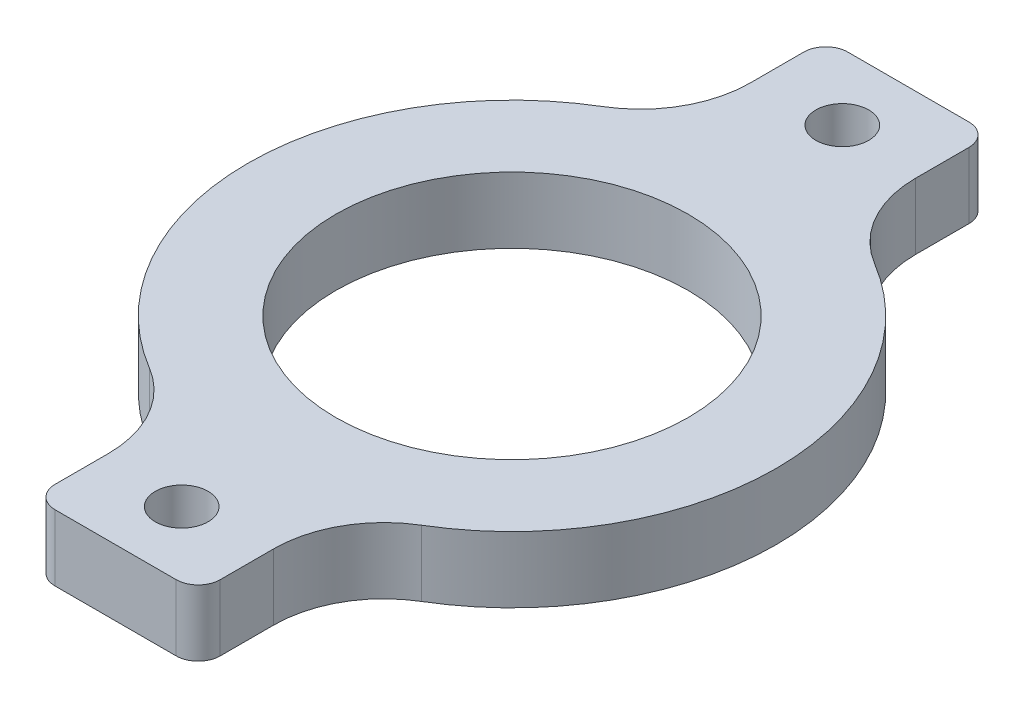
ISO-10303-21;
HEADER;
FILE_DESCRIPTION(('STEP AP214'),'2;1');
FILE_NAME('part.step','',(''),(''),'','','');
FILE_SCHEMA(('AUTOMOTIVE_DESIGN { 1 0 10303 214 1 1 1 1 }'));
ENDSEC;
DATA;
#1=APPLICATION_CONTEXT('core data for automotive mechanical design processes');
#2=APPLICATION_PROTOCOL_DEFINITION('international standard','automotive_design',2000,#1);
#3=PRODUCT_CONTEXT('',#1,'mechanical');
#4=PRODUCT('Part','Part','',(#3));
#5=PRODUCT_RELATED_PRODUCT_CATEGORY('part','',(#4));
#6=PRODUCT_DEFINITION_FORMATION('','',#4);
#7=PRODUCT_DEFINITION_CONTEXT('part definition',#1,'design');
#8=PRODUCT_DEFINITION('design','',#6,#7);
#9=PRODUCT_DEFINITION_SHAPE('','',#8);
#10=(LENGTH_UNIT() NAMED_UNIT(*) SI_UNIT(.MILLI.,.METRE.));
#11=(NAMED_UNIT(*) PLANE_ANGLE_UNIT() SI_UNIT($,.RADIAN.));
#12=(NAMED_UNIT(*) SI_UNIT($,.STERADIAN.) SOLID_ANGLE_UNIT());
#13=UNCERTAINTY_MEASURE_WITH_UNIT(LENGTH_MEASURE(1.E-05),#10,'distance_accuracy_value','');
#14=(GEOMETRIC_REPRESENTATION_CONTEXT(3) GLOBAL_UNCERTAINTY_ASSIGNED_CONTEXT((#13)) GLOBAL_UNIT_ASSIGNED_CONTEXT((#10,
#11,#12)) REPRESENTATION_CONTEXT('',''));
#15=CARTESIAN_POINT('',(0.,0.,0.));
#16=DIRECTION('',(0.,0.,1.));
#17=DIRECTION('',(1.,0.,0.));
#18=AXIS2_PLACEMENT_3D('',#15,#16,#17);
#19=CARTESIAN_POINT('',(0.,3.,0.));
#20=DIRECTION('',(0.,1.,0.));
#21=DIRECTION('',(0.,0.,1.));
#22=AXIS2_PLACEMENT_3D('',#19,#20,#21);
#23=PLANE('',#22);
#24=CARTESIAN_POINT('',(0.,3.,-15.));
#25=DIRECTION('',(0.,1.,0.));
#26=DIRECTION('',(0.,0.,1.));
#27=AXIS2_PLACEMENT_3D('',#24,#25,#26);
#28=CIRCLE('',#27,1.2);
#29=CARTESIAN_POINT('',(0.,3.,-13.8));
#30=VERTEX_POINT('',#29);
#31=EDGE_CURVE('E311',#30,#30,#28,.T.);
#32=ORIENTED_EDGE('',*,*,#31,.F.);
#33=EDGE_LOOP('',(#32));
#34=FACE_BOUND('',#33,.T.);
#35=CARTESIAN_POINT('',(0.,3.,15.));
#36=DIRECTION('',(0.,1.,0.));
#37=DIRECTION('',(0.,0.,1.));
#38=AXIS2_PLACEMENT_3D('',#35,#36,#37);
#39=CIRCLE('',#38,1.2);
#40=CARTESIAN_POINT('',(0.,3.,16.2));
#41=VERTEX_POINT('',#40);
#42=EDGE_CURVE('E305',#41,#41,#39,.T.);
#43=ORIENTED_EDGE('',*,*,#42,.F.);
#44=EDGE_LOOP('',(#43));
#45=FACE_BOUND('',#44,.T.);
#46=DIRECTION('',(1.,0.,0.));
#47=VECTOR('',#46,1.);
#48=CARTESIAN_POINT('',(-3.75,3.,18.));
#49=LINE('',#48,#47);
#50=CARTESIAN_POINT('',(-2.75,3.,18.));
#51=VERTEX_POINT('',#50);
#52=CARTESIAN_POINT('',(2.75,3.,18.));
#53=VERTEX_POINT('',#52);
#54=EDGE_CURVE('E288',#51,#53,#49,.T.);
#55=ORIENTED_EDGE('',*,*,#54,.T.);
#56=CARTESIAN_POINT('',(2.75,3.,17.));
#57=DIRECTION('',(0.,1.,0.));
#58=DIRECTION('',(0.,0.,1.));
#59=AXIS2_PLACEMENT_3D('',#56,#57,#58);
#60=CIRCLE('',#59,1.);
#61=CARTESIAN_POINT('',(3.75,3.,17.));
#62=VERTEX_POINT('',#61);
#63=EDGE_CURVE('E247',#53,#62,#60,.T.);
#64=ORIENTED_EDGE('',*,*,#63,.T.);
#65=DIRECTION('',(0.,0.,-1.));
#66=VECTOR('',#65,1.);
#67=CARTESIAN_POINT('',(3.75,3.,18.));
#68=LINE('',#67,#66);
#69=CARTESIAN_POINT('',(3.75,3.,14.5752358471484));
#70=VERTEX_POINT('',#69);
#71=EDGE_CURVE('E286',#62,#70,#68,.T.);
#72=ORIENTED_EDGE('',*,*,#71,.T.);
#73=CARTESIAN_POINT('',(8.75,3.,14.5752358471484));
#74=DIRECTION('',(0.,1.,0.));
#75=DIRECTION('',(0.,0.,1.));
#76=AXIS2_PLACEMENT_3D('',#73,#74,#75);
#77=CIRCLE('',#76,5.);
#78=CARTESIAN_POINT('',(6.1764705882353,3.,10.2884017744577));
#79=VERTEX_POINT('',#78);
#80=EDGE_CURVE('E216',#70,#79,#77,.F.);
#81=ORIENTED_EDGE('',*,*,#80,.T.);
#82=CARTESIAN_POINT('',(0.,3.,0.));
#83=DIRECTION('',(0.,1.,0.));
#84=DIRECTION('',(0.,0.,1.));
#85=AXIS2_PLACEMENT_3D('',#82,#83,#84);
#86=CIRCLE('',#85,12.);
#87=CARTESIAN_POINT('',(6.1764705882353,3.,-10.2884017744577));
#88=VERTEX_POINT('',#87);
#89=EDGE_CURVE('E174',#79,#88,#86,.T.);
#90=ORIENTED_EDGE('',*,*,#89,.T.);
#91=CARTESIAN_POINT('',(8.75,3.,-14.5752358471484));
#92=DIRECTION('',(0.,1.,0.));
#93=DIRECTION('',(0.,0.,1.));
#94=AXIS2_PLACEMENT_3D('',#91,#92,#93);
#95=CIRCLE('',#94,5.);
#96=CARTESIAN_POINT('',(3.75,3.,-14.5752358471484));
#97=VERTEX_POINT('',#96);
#98=EDGE_CURVE('E220',#88,#97,#95,.F.);
#99=ORIENTED_EDGE('',*,*,#98,.T.);
#100=DIRECTION('',(0.,0.,-1.));
#101=VECTOR('',#100,1.);
#102=CARTESIAN_POINT('',(3.75,3.,-18.));
#103=LINE('',#102,#101);
#104=CARTESIAN_POINT('',(3.75,3.,-17.));
#105=VERTEX_POINT('',#104);
#106=EDGE_CURVE('E194',#97,#105,#103,.T.);
#107=ORIENTED_EDGE('',*,*,#106,.T.);
#108=CARTESIAN_POINT('',(2.75,3.,-17.));
#109=DIRECTION('',(0.,1.,0.));
#110=DIRECTION('',(0.,0.,1.));
#111=AXIS2_PLACEMENT_3D('',#108,#109,#110);
#112=CIRCLE('',#111,1.);
#113=CARTESIAN_POINT('',(2.75,3.,-18.));
#114=VERTEX_POINT('',#113);
#115=EDGE_CURVE('E243',#105,#114,#112,.T.);
#116=ORIENTED_EDGE('',*,*,#115,.T.);
#117=DIRECTION('',(-1.,0.,0.));
#118=VECTOR('',#117,1.);
#119=CARTESIAN_POINT('',(-3.75,3.,-18.));
#120=LINE('',#119,#118);
#121=CARTESIAN_POINT('',(-2.75,3.,-18.));
#122=VERTEX_POINT('',#121);
#123=EDGE_CURVE('E270',#114,#122,#120,.T.);
#124=ORIENTED_EDGE('',*,*,#123,.T.);
#125=CARTESIAN_POINT('',(-2.75,3.,-17.));
#126=DIRECTION('',(0.,1.,0.));
#127=DIRECTION('',(0.,0.,1.));
#128=AXIS2_PLACEMENT_3D('',#125,#126,#127);
#129=CIRCLE('',#128,1.);
#130=CARTESIAN_POINT('',(-3.75,3.,-17.));
#131=VERTEX_POINT('',#130);
#132=EDGE_CURVE('E64',#122,#131,#129,.T.);
#133=ORIENTED_EDGE('',*,*,#132,.T.);
#134=DIRECTION('',(0.,0.,1.));
#135=VECTOR('',#134,1.);
#136=CARTESIAN_POINT('',(-3.75,3.,-18.));
#137=LINE('',#136,#135);
#138=CARTESIAN_POINT('',(-3.75,3.,-14.5752358471484));
#139=VERTEX_POINT('',#138);
#140=EDGE_CURVE('E294',#131,#139,#137,.T.);
#141=ORIENTED_EDGE('',*,*,#140,.T.);
#142=CARTESIAN_POINT('',(-8.75,3.,-14.5752358471484));
#143=DIRECTION('',(0.,1.,0.));
#144=DIRECTION('',(0.,0.,1.));
#145=AXIS2_PLACEMENT_3D('',#142,#143,#144);
#146=CIRCLE('',#145,5.);
#147=CARTESIAN_POINT('',(-6.1764705882353,3.,-10.2884017744577));
#148=VERTEX_POINT('',#147);
#149=EDGE_CURVE('E225',#139,#148,#146,.F.);
#150=ORIENTED_EDGE('',*,*,#149,.T.);
#151=CARTESIAN_POINT('',(0.,3.,0.));
#152=DIRECTION('',(0.,1.,0.));
#153=DIRECTION('',(0.,0.,1.));
#154=AXIS2_PLACEMENT_3D('',#151,#152,#153);
#155=CIRCLE('',#154,12.);
#156=CARTESIAN_POINT('',(-6.1764705882353,3.,10.2884017744577));
#157=VERTEX_POINT('',#156);
#158=EDGE_CURVE('E291',#148,#157,#155,.T.);
#159=ORIENTED_EDGE('',*,*,#158,.T.);
#160=CARTESIAN_POINT('',(-8.75,3.,14.5752358471484));
#161=DIRECTION('',(0.,1.,0.));
#162=DIRECTION('',(0.,0.,1.));
#163=AXIS2_PLACEMENT_3D('',#160,#161,#162);
#164=CIRCLE('',#163,5.);
#165=CARTESIAN_POINT('',(-3.75,3.,14.5752358471484));
#166=VERTEX_POINT('',#165);
#167=EDGE_CURVE('E167',#157,#166,#164,.F.);
#168=ORIENTED_EDGE('',*,*,#167,.T.);
#169=DIRECTION('',(0.,0.,1.));
#170=VECTOR('',#169,1.);
#171=CARTESIAN_POINT('',(-3.75,3.,18.));
#172=LINE('',#171,#170);
#173=CARTESIAN_POINT('',(-3.75,3.,17.));
#174=VERTEX_POINT('',#173);
#175=EDGE_CURVE('E172',#166,#174,#172,.T.);
#176=ORIENTED_EDGE('',*,*,#175,.T.);
#177=CARTESIAN_POINT('',(-2.75,3.,17.));
#178=DIRECTION('',(0.,1.,0.));
#179=DIRECTION('',(0.,0.,1.));
#180=AXIS2_PLACEMENT_3D('',#177,#178,#179);
#181=CIRCLE('',#180,1.);
#182=EDGE_CURVE('E245',#174,#51,#181,.T.);
#183=ORIENTED_EDGE('',*,*,#182,.T.);
#184=EDGE_LOOP('',(#55,#64,#72,#81,#90,#99,#107,#116,#124,#133,#141,#150,#159,#168,#176,#183));
#185=FACE_BOUND('',#184,.T.);
#186=CARTESIAN_POINT('',(0.,3.,0.));
#187=DIRECTION('',(0.,1.,0.));
#188=DIRECTION('',(0.,0.,1.));
#189=AXIS2_PLACEMENT_3D('',#186,#187,#188);
#190=CIRCLE('',#189,8.);
#191=CARTESIAN_POINT('',(0.,3.,8.));
#192=VERTEX_POINT('',#191);
#193=EDGE_CURVE('E282',#192,#192,#190,.T.);
#194=ORIENTED_EDGE('',*,*,#193,.F.);
#195=EDGE_LOOP('',(#194));
#196=FACE_BOUND('',#195,.T.);
#197=ADVANCED_FACE('F41',(#34,#45,#185,#196),#23,.T.);
#198=CARTESIAN_POINT('',(0.,0.,0.));
#199=DIRECTION('',(0.,1.,0.));
#200=DIRECTION('',(0.,0.,1.));
#201=AXIS2_PLACEMENT_3D('',#198,#199,#200);
#202=PLANE('',#201);
#203=CARTESIAN_POINT('',(0.,0.,-15.));
#204=DIRECTION('',(0.,1.,0.));
#205=DIRECTION('',(0.,0.,1.));
#206=AXIS2_PLACEMENT_3D('',#203,#204,#205);
#207=CIRCLE('',#206,1.2);
#208=CARTESIAN_POINT('',(0.,0.,-13.8));
#209=VERTEX_POINT('',#208);
#210=EDGE_CURVE('E308',#209,#209,#207,.T.);
#211=ORIENTED_EDGE('',*,*,#210,.T.);
#212=EDGE_LOOP('',(#211));
#213=FACE_BOUND('',#212,.T.);
#214=CARTESIAN_POINT('',(0.,0.,15.));
#215=DIRECTION('',(0.,1.,0.));
#216=DIRECTION('',(0.,0.,1.));
#217=AXIS2_PLACEMENT_3D('',#214,#215,#216);
#218=CIRCLE('',#217,1.2);
#219=CARTESIAN_POINT('',(0.,0.,16.2));
#220=VERTEX_POINT('',#219);
#221=EDGE_CURVE('E300',#220,#220,#218,.T.);
#222=ORIENTED_EDGE('',*,*,#221,.T.);
#223=EDGE_LOOP('',(#222));
#224=FACE_BOUND('',#223,.T.);
#225=DIRECTION('',(0.,0.,-1.));
#226=VECTOR('',#225,1.);
#227=CARTESIAN_POINT('',(3.75,0.,18.));
#228=LINE('',#227,#226);
#229=CARTESIAN_POINT('',(3.75,0.,17.));
#230=VERTEX_POINT('',#229);
#231=CARTESIAN_POINT('',(3.75,0.,14.5752358471484));
#232=VERTEX_POINT('',#231);
#233=EDGE_CURVE('E185',#230,#232,#228,.T.);
#234=ORIENTED_EDGE('',*,*,#233,.F.);
#235=CARTESIAN_POINT('',(2.75,0.,17.));
#236=DIRECTION('',(0.,1.,0.));
#237=DIRECTION('',(0.,0.,1.));
#238=AXIS2_PLACEMENT_3D('',#235,#236,#237);
#239=CIRCLE('',#238,1.);
#240=CARTESIAN_POINT('',(2.75,0.,18.));
#241=VERTEX_POINT('',#240);
#242=EDGE_CURVE('E235',#230,#241,#239,.F.);
#243=ORIENTED_EDGE('',*,*,#242,.T.);
#244=DIRECTION('',(1.,0.,0.));
#245=VECTOR('',#244,1.);
#246=CARTESIAN_POINT('',(-3.75,0.,18.));
#247=LINE('',#246,#245);
#248=CARTESIAN_POINT('',(-2.75,0.,18.));
#249=VERTEX_POINT('',#248);
#250=EDGE_CURVE('E181',#249,#241,#247,.T.);
#251=ORIENTED_EDGE('',*,*,#250,.F.);
#252=CARTESIAN_POINT('',(-2.75,0.,17.));
#253=DIRECTION('',(0.,1.,0.));
#254=DIRECTION('',(0.,0.,1.));
#255=AXIS2_PLACEMENT_3D('',#252,#253,#254);
#256=CIRCLE('',#255,1.);
#257=CARTESIAN_POINT('',(-3.75,0.,17.));
#258=VERTEX_POINT('',#257);
#259=EDGE_CURVE('E180',#249,#258,#256,.F.);
#260=ORIENTED_EDGE('',*,*,#259,.T.);
#261=DIRECTION('',(0.,0.,1.));
#262=VECTOR('',#261,1.);
#263=CARTESIAN_POINT('',(-3.75,0.,18.));
#264=LINE('',#263,#262);
#265=CARTESIAN_POINT('',(-3.75,0.,14.5752358471484));
#266=VERTEX_POINT('',#265);
#267=EDGE_CURVE('E171',#266,#258,#264,.T.);
#268=ORIENTED_EDGE('',*,*,#267,.F.);
#269=CARTESIAN_POINT('',(-8.75,0.,14.5752358471484));
#270=DIRECTION('',(0.,1.,0.));
#271=DIRECTION('',(0.,0.,1.));
#272=AXIS2_PLACEMENT_3D('',#269,#270,#271);
#273=CIRCLE('',#272,5.);
#274=CARTESIAN_POINT('',(-6.1764705882353,0.,10.2884017744577));
#275=VERTEX_POINT('',#274);
#276=EDGE_CURVE('E157',#266,#275,#273,.T.);
#277=ORIENTED_EDGE('',*,*,#276,.T.);
#278=CARTESIAN_POINT('',(0.,0.,0.));
#279=DIRECTION('',(0.,1.,0.));
#280=DIRECTION('',(0.,0.,1.));
#281=AXIS2_PLACEMENT_3D('',#278,#279,#280);
#282=CIRCLE('',#281,12.);
#283=CARTESIAN_POINT('',(-6.1764705882353,0.,-10.2884017744577));
#284=VERTEX_POINT('',#283);
#285=EDGE_CURVE('E182',#284,#275,#282,.T.);
#286=ORIENTED_EDGE('',*,*,#285,.F.);
#287=CARTESIAN_POINT('',(-8.75,0.,-14.5752358471484));
#288=DIRECTION('',(0.,1.,0.));
#289=DIRECTION('',(0.,0.,1.));
#290=AXIS2_PLACEMENT_3D('',#287,#288,#289);
#291=CIRCLE('',#290,5.);
#292=CARTESIAN_POINT('',(-3.75,0.,-14.5752358471484));
#293=VERTEX_POINT('',#292);
#294=EDGE_CURVE('E222',#284,#293,#291,.T.);
#295=ORIENTED_EDGE('',*,*,#294,.T.);
#296=DIRECTION('',(0.,0.,1.));
#297=VECTOR('',#296,1.);
#298=CARTESIAN_POINT('',(-3.75,0.,-18.));
#299=LINE('',#298,#297);
#300=CARTESIAN_POINT('',(-3.75,0.,-17.));
#301=VERTEX_POINT('',#300);
#302=EDGE_CURVE('E187',#301,#293,#299,.T.);
#303=ORIENTED_EDGE('',*,*,#302,.F.);
#304=CARTESIAN_POINT('',(-2.75,0.,-17.));
#305=DIRECTION('',(0.,1.,0.));
#306=DIRECTION('',(0.,0.,1.));
#307=AXIS2_PLACEMENT_3D('',#304,#305,#306);
#308=CIRCLE('',#307,1.);
#309=CARTESIAN_POINT('',(-2.75,0.,-18.));
#310=VERTEX_POINT('',#309);
#311=EDGE_CURVE('E230',#301,#310,#308,.F.);
#312=ORIENTED_EDGE('',*,*,#311,.T.);
#313=DIRECTION('',(-1.,0.,0.));
#314=VECTOR('',#313,1.);
#315=CARTESIAN_POINT('',(-3.75,0.,-18.));
#316=LINE('',#315,#314);
#317=CARTESIAN_POINT('',(2.75,0.,-18.));
#318=VERTEX_POINT('',#317);
#319=EDGE_CURVE('E278',#318,#310,#316,.T.);
#320=ORIENTED_EDGE('',*,*,#319,.F.);
#321=CARTESIAN_POINT('',(2.75,0.,-17.));
#322=DIRECTION('',(0.,1.,0.));
#323=DIRECTION('',(0.,0.,1.));
#324=AXIS2_PLACEMENT_3D('',#321,#322,#323);
#325=CIRCLE('',#324,1.);
#326=CARTESIAN_POINT('',(3.75,0.,-17.));
#327=VERTEX_POINT('',#326);
#328=EDGE_CURVE('E232',#318,#327,#325,.F.);
#329=ORIENTED_EDGE('',*,*,#328,.T.);
#330=DIRECTION('',(0.,0.,-1.));
#331=VECTOR('',#330,1.);
#332=CARTESIAN_POINT('',(3.75,0.,-18.));
#333=LINE('',#332,#331);
#334=CARTESIAN_POINT('',(3.75,0.,-14.5752358471484));
#335=VERTEX_POINT('',#334);
#336=EDGE_CURVE('E262',#335,#327,#333,.T.);
#337=ORIENTED_EDGE('',*,*,#336,.F.);
#338=CARTESIAN_POINT('',(8.75,0.,-14.5752358471484));
#339=DIRECTION('',(0.,1.,0.));
#340=DIRECTION('',(0.,0.,1.));
#341=AXIS2_PLACEMENT_3D('',#338,#339,#340);
#342=CIRCLE('',#341,5.);
#343=CARTESIAN_POINT('',(6.1764705882353,0.,-10.2884017744577));
#344=VERTEX_POINT('',#343);
#345=EDGE_CURVE('E218',#335,#344,#342,.T.);
#346=ORIENTED_EDGE('',*,*,#345,.T.);
#347=CARTESIAN_POINT('',(0.,0.,0.));
#348=DIRECTION('',(0.,1.,0.));
#349=DIRECTION('',(0.,0.,1.));
#350=AXIS2_PLACEMENT_3D('',#347,#348,#349);
#351=CIRCLE('',#350,12.);
#352=CARTESIAN_POINT('',(6.1764705882353,0.,10.2884017744577));
#353=VERTEX_POINT('',#352);
#354=EDGE_CURVE('E192',#353,#344,#351,.T.);
#355=ORIENTED_EDGE('',*,*,#354,.F.);
#356=CARTESIAN_POINT('',(8.75,0.,14.5752358471484));
#357=DIRECTION('',(0.,1.,0.));
#358=DIRECTION('',(0.,0.,1.));
#359=AXIS2_PLACEMENT_3D('',#356,#357,#358);
#360=CIRCLE('',#359,5.);
#361=EDGE_CURVE('E213',#353,#232,#360,.T.);
#362=ORIENTED_EDGE('',*,*,#361,.T.);
#363=EDGE_LOOP('',(#234,#243,#251,#260,#268,#277,#286,#295,#303,#312,#320,#329,#337,#346,#355,#362));
#364=FACE_BOUND('',#363,.T.);
#365=CARTESIAN_POINT('',(0.,0.,0.));
#366=DIRECTION('',(0.,1.,0.));
#367=DIRECTION('',(0.,0.,1.));
#368=AXIS2_PLACEMENT_3D('',#365,#366,#367);
#369=CIRCLE('',#368,8.);
#370=CARTESIAN_POINT('',(0.,0.,8.));
#371=VERTEX_POINT('',#370);
#372=EDGE_CURVE('E297',#371,#371,#369,.T.);
#373=ORIENTED_EDGE('',*,*,#372,.T.);
#374=EDGE_LOOP('',(#373));
#375=FACE_BOUND('',#374,.T.);
#376=ADVANCED_FACE('F177',(#213,#224,#364,#375),#202,.F.);
#377=CARTESIAN_POINT('',(3.75,3.,-18.));
#378=DIRECTION('',(-1.,0.,0.));
#379=DIRECTION('',(0.,0.,1.));
#380=AXIS2_PLACEMENT_3D('',#377,#378,#379);
#381=PLANE('',#380);
#382=ORIENTED_EDGE('',*,*,#336,.T.);
#383=DIRECTION('',(0.,-1.,0.));
#384=VECTOR('',#383,1.);
#385=CARTESIAN_POINT('',(3.75,3.,-17.));
#386=LINE('',#385,#384);
#387=EDGE_CURVE('E49',#327,#105,#386,.F.);
#388=ORIENTED_EDGE('',*,*,#387,.T.);
#389=ORIENTED_EDGE('',*,*,#106,.F.);
#390=DIRECTION('',(0.,1.,0.));
#391=VECTOR('',#390,1.);
#392=CARTESIAN_POINT('',(3.75,0.,-14.5752358471484));
#393=LINE('',#392,#391);
#394=EDGE_CURVE('E207',#97,#335,#393,.F.);
#395=ORIENTED_EDGE('',*,*,#394,.T.);
#396=EDGE_LOOP('',(#382,#388,#389,#395));
#397=FACE_BOUND('',#396,.T.);
#398=ADVANCED_FACE('F259',(#397),#381,.F.);
#399=CARTESIAN_POINT('',(-3.75,3.,-18.));
#400=DIRECTION('',(0.,0.,1.));
#401=DIRECTION('',(1.,0.,0.));
#402=AXIS2_PLACEMENT_3D('',#399,#400,#401);
#403=PLANE('',#402);
#404=ORIENTED_EDGE('',*,*,#123,.F.);
#405=DIRECTION('',(0.,-1.,0.));
#406=VECTOR('',#405,1.);
#407=CARTESIAN_POINT('',(2.75,3.,-18.));
#408=LINE('',#407,#406);
#409=EDGE_CURVE('E252',#114,#318,#408,.T.);
#410=ORIENTED_EDGE('',*,*,#409,.T.);
#411=ORIENTED_EDGE('',*,*,#319,.T.);
#412=DIRECTION('',(0.,-1.,0.));
#413=VECTOR('',#412,1.);
#414=CARTESIAN_POINT('',(-2.75,3.,-18.));
#415=LINE('',#414,#413);
#416=EDGE_CURVE('E250',#310,#122,#415,.F.);
#417=ORIENTED_EDGE('',*,*,#416,.T.);
#418=EDGE_LOOP('',(#404,#410,#411,#417));
#419=FACE_BOUND('',#418,.T.);
#420=ADVANCED_FACE('F277',(#419),#403,.F.);
#421=CARTESIAN_POINT('',(-3.75,3.,-18.));
#422=DIRECTION('',(1.,0.,0.));
#423=DIRECTION('',(0.,0.,-1.));
#424=AXIS2_PLACEMENT_3D('',#421,#422,#423);
#425=PLANE('',#424);
#426=ORIENTED_EDGE('',*,*,#140,.F.);
#427=DIRECTION('',(0.,-1.,0.));
#428=VECTOR('',#427,1.);
#429=CARTESIAN_POINT('',(-3.75,3.,-17.));
#430=LINE('',#429,#428);
#431=EDGE_CURVE('E11',#131,#301,#430,.T.);
#432=ORIENTED_EDGE('',*,*,#431,.T.);
#433=ORIENTED_EDGE('',*,*,#302,.T.);
#434=DIRECTION('',(0.,1.,0.));
#435=VECTOR('',#434,1.);
#436=CARTESIAN_POINT('',(-3.75,3.,-14.5752358471484));
#437=LINE('',#436,#435);
#438=EDGE_CURVE('E168',#293,#139,#437,.T.);
#439=ORIENTED_EDGE('',*,*,#438,.T.);
#440=EDGE_LOOP('',(#426,#432,#433,#439));
#441=FACE_BOUND('',#440,.T.);
#442=ADVANCED_FACE('F357',(#441),#425,.F.);
#443=CARTESIAN_POINT('',(0.,3.,0.));
#444=DIRECTION('',(0.,-1.,0.));
#445=DIRECTION('',(0.,0.,-1.));
#446=AXIS2_PLACEMENT_3D('',#443,#444,#445);
#447=CYLINDRICAL_SURFACE('',#446,12.);
#448=ORIENTED_EDGE('',*,*,#285,.T.);
#449=DIRECTION('',(0.,-1.,0.));
#450=VECTOR('',#449,1.);
#451=CARTESIAN_POINT('',(-6.1764705882353,3.,10.2884017744577));
#452=LINE('',#451,#450);
#453=EDGE_CURVE('E162',#275,#157,#452,.F.);
#454=ORIENTED_EDGE('',*,*,#453,.T.);
#455=ORIENTED_EDGE('',*,*,#158,.F.);
#456=DIRECTION('',(0.,-1.,0.));
#457=VECTOR('',#456,1.);
#458=CARTESIAN_POINT('',(-6.1764705882353,3.,-10.2884017744577));
#459=LINE('',#458,#457);
#460=EDGE_CURVE('E173',#148,#284,#459,.T.);
#461=ORIENTED_EDGE('',*,*,#460,.T.);
#462=EDGE_LOOP('',(#448,#454,#455,#461));
#463=FACE_BOUND('',#462,.T.);
#464=ADVANCED_FACE('F354',(#463),#447,.T.);
#465=CARTESIAN_POINT('',(-3.75,3.,18.));
#466=DIRECTION('',(1.,0.,0.));
#467=DIRECTION('',(0.,0.,-1.));
#468=AXIS2_PLACEMENT_3D('',#465,#466,#467);
#469=PLANE('',#468);
#470=ORIENTED_EDGE('',*,*,#267,.T.);
#471=DIRECTION('',(0.,-1.,0.));
#472=VECTOR('',#471,1.);
#473=CARTESIAN_POINT('',(-3.75,3.,17.));
#474=LINE('',#473,#472);
#475=EDGE_CURVE('E56',#258,#174,#474,.F.);
#476=ORIENTED_EDGE('',*,*,#475,.T.);
#477=ORIENTED_EDGE('',*,*,#175,.F.);
#478=DIRECTION('',(0.,1.,0.));
#479=VECTOR('',#478,1.);
#480=CARTESIAN_POINT('',(-3.75,0.,14.5752358471484));
#481=LINE('',#480,#479);
#482=EDGE_CURVE('E161',#166,#266,#481,.F.);
#483=ORIENTED_EDGE('',*,*,#482,.T.);
#484=EDGE_LOOP('',(#470,#476,#477,#483));
#485=FACE_BOUND('',#484,.T.);
#486=ADVANCED_FACE('F170',(#485),#469,.F.);
#487=CARTESIAN_POINT('',(-3.75,3.,18.));
#488=DIRECTION('',(0.,0.,-1.));
#489=DIRECTION('',(-1.,0.,0.));
#490=AXIS2_PLACEMENT_3D('',#487,#488,#489);
#491=PLANE('',#490);
#492=ORIENTED_EDGE('',*,*,#250,.T.);
#493=DIRECTION('',(0.,-1.,0.));
#494=VECTOR('',#493,1.);
#495=CARTESIAN_POINT('',(2.75,3.,18.));
#496=LINE('',#495,#494);
#497=EDGE_CURVE('E240',#241,#53,#496,.F.);
#498=ORIENTED_EDGE('',*,*,#497,.T.);
#499=ORIENTED_EDGE('',*,*,#54,.F.);
#500=DIRECTION('',(0.,-1.,0.));
#501=VECTOR('',#500,1.);
#502=CARTESIAN_POINT('',(-2.75,3.,18.));
#503=LINE('',#502,#501);
#504=EDGE_CURVE('E237',#51,#249,#503,.T.);
#505=ORIENTED_EDGE('',*,*,#504,.T.);
#506=EDGE_LOOP('',(#492,#498,#499,#505));
#507=FACE_BOUND('',#506,.T.);
#508=ADVANCED_FACE('F347',(#507),#491,.F.);
#509=CARTESIAN_POINT('',(3.75,3.,18.));
#510=DIRECTION('',(-1.,0.,0.));
#511=DIRECTION('',(0.,0.,1.));
#512=AXIS2_PLACEMENT_3D('',#509,#510,#511);
#513=PLANE('',#512);
#514=ORIENTED_EDGE('',*,*,#71,.F.);
#515=DIRECTION('',(0.,-1.,0.));
#516=VECTOR('',#515,1.);
#517=CARTESIAN_POINT('',(3.75,3.,17.));
#518=LINE('',#517,#516);
#519=EDGE_CURVE('E227',#62,#230,#518,.T.);
#520=ORIENTED_EDGE('',*,*,#519,.T.);
#521=ORIENTED_EDGE('',*,*,#233,.T.);
#522=DIRECTION('',(0.,1.,0.));
#523=VECTOR('',#522,1.);
#524=CARTESIAN_POINT('',(3.75,3.,14.5752358471484));
#525=LINE('',#524,#523);
#526=EDGE_CURVE('E204',#232,#70,#525,.T.);
#527=ORIENTED_EDGE('',*,*,#526,.T.);
#528=EDGE_LOOP('',(#514,#520,#521,#527));
#529=FACE_BOUND('',#528,.T.);
#530=ADVANCED_FACE('F343',(#529),#513,.F.);
#531=CARTESIAN_POINT('',(0.,3.,0.));
#532=DIRECTION('',(0.,-1.,0.));
#533=DIRECTION('',(0.,0.,-1.));
#534=AXIS2_PLACEMENT_3D('',#531,#532,#533);
#535=CYLINDRICAL_SURFACE('',#534,12.);
#536=ORIENTED_EDGE('',*,*,#89,.F.);
#537=DIRECTION('',(0.,-1.,0.));
#538=VECTOR('',#537,1.);
#539=CARTESIAN_POINT('',(6.1764705882353,3.,10.2884017744577));
#540=LINE('',#539,#538);
#541=EDGE_CURVE('E201',#79,#353,#540,.T.);
#542=ORIENTED_EDGE('',*,*,#541,.T.);
#543=ORIENTED_EDGE('',*,*,#354,.T.);
#544=DIRECTION('',(0.,-1.,0.));
#545=VECTOR('',#544,1.);
#546=CARTESIAN_POINT('',(6.1764705882353,3.,-10.2884017744577));
#547=LINE('',#546,#545);
#548=EDGE_CURVE('E199',#344,#88,#547,.F.);
#549=ORIENTED_EDGE('',*,*,#548,.T.);
#550=EDGE_LOOP('',(#536,#542,#543,#549));
#551=FACE_BOUND('',#550,.T.);
#552=ADVANCED_FACE('F333',(#551),#535,.T.);
#553=CARTESIAN_POINT('',(0.,3.,0.));
#554=DIRECTION('',(0.,-1.,0.));
#555=DIRECTION('',(0.,0.,-1.));
#556=AXIS2_PLACEMENT_3D('',#553,#554,#555);
#557=CYLINDRICAL_SURFACE('',#556,8.);
#558=ORIENTED_EDGE('',*,*,#193,.T.);
#559=EDGE_LOOP('',(#558));
#560=FACE_BOUND('',#559,.T.);
#561=ORIENTED_EDGE('',*,*,#372,.F.);
#562=EDGE_LOOP('',(#561));
#563=FACE_BOUND('',#562,.T.);
#564=ADVANCED_FACE('F324',(#560,#563),#557,.F.);
#565=CARTESIAN_POINT('',(0.,3.,15.));
#566=DIRECTION('',(0.,1.,0.));
#567=DIRECTION('',(0.,0.,1.));
#568=AXIS2_PLACEMENT_3D('',#565,#566,#567);
#569=CYLINDRICAL_SURFACE('',#568,1.2);
#570=ORIENTED_EDGE('',*,*,#221,.F.);
#571=EDGE_LOOP('',(#570));
#572=FACE_BOUND('',#571,.T.);
#573=ORIENTED_EDGE('',*,*,#42,.T.);
#574=EDGE_LOOP('',(#573));
#575=FACE_BOUND('',#574,.T.);
#576=ADVANCED_FACE('F322',(#572,#575),#569,.F.);
#577=CARTESIAN_POINT('',(0.,3.,-15.));
#578=DIRECTION('',(0.,1.,0.));
#579=DIRECTION('',(0.,0.,1.));
#580=AXIS2_PLACEMENT_3D('',#577,#578,#579);
#581=CYLINDRICAL_SURFACE('',#580,1.2);
#582=ORIENTED_EDGE('',*,*,#210,.F.);
#583=EDGE_LOOP('',(#582));
#584=FACE_BOUND('',#583,.T.);
#585=ORIENTED_EDGE('',*,*,#31,.T.);
#586=EDGE_LOOP('',(#585));
#587=FACE_BOUND('',#586,.T.);
#588=ADVANCED_FACE('F315',(#584,#587),#581,.F.);
#589=CARTESIAN_POINT('',(-8.75,3.,14.5752358471484));
#590=DIRECTION('',(0.,-1.,0.));
#591=DIRECTION('',(0.,0.,-1.));
#592=AXIS2_PLACEMENT_3D('',#589,#590,#591);
#593=CYLINDRICAL_SURFACE('',#592,5.);
#594=ORIENTED_EDGE('',*,*,#167,.F.);
#595=ORIENTED_EDGE('',*,*,#453,.F.);
#596=ORIENTED_EDGE('',*,*,#276,.F.);
#597=ORIENTED_EDGE('',*,*,#482,.F.);
#598=EDGE_LOOP('',(#594,#595,#596,#597));
#599=FACE_BOUND('',#598,.T.);
#600=ADVANCED_FACE('F160',(#599),#593,.F.);
#601=CARTESIAN_POINT('',(8.75,3.,14.5752358471484));
#602=DIRECTION('',(0.,-1.,0.));
#603=DIRECTION('',(0.,0.,-1.));
#604=AXIS2_PLACEMENT_3D('',#601,#602,#603);
#605=CYLINDRICAL_SURFACE('',#604,5.);
#606=ORIENTED_EDGE('',*,*,#80,.F.);
#607=ORIENTED_EDGE('',*,*,#526,.F.);
#608=ORIENTED_EDGE('',*,*,#361,.F.);
#609=ORIENTED_EDGE('',*,*,#541,.F.);
#610=EDGE_LOOP('',(#606,#607,#608,#609));
#611=FACE_BOUND('',#610,.T.);
#612=ADVANCED_FACE('F368',(#611),#605,.F.);
#613=CARTESIAN_POINT('',(8.75,3.,-14.5752358471484));
#614=DIRECTION('',(0.,-1.,0.));
#615=DIRECTION('',(0.,0.,-1.));
#616=AXIS2_PLACEMENT_3D('',#613,#614,#615);
#617=CYLINDRICAL_SURFACE('',#616,5.);
#618=ORIENTED_EDGE('',*,*,#98,.F.);
#619=ORIENTED_EDGE('',*,*,#548,.F.);
#620=ORIENTED_EDGE('',*,*,#345,.F.);
#621=ORIENTED_EDGE('',*,*,#394,.F.);
#622=EDGE_LOOP('',(#618,#619,#620,#621));
#623=FACE_BOUND('',#622,.T.);
#624=ADVANCED_FACE('F371',(#623),#617,.F.);
#625=CARTESIAN_POINT('',(-8.75,3.,-14.5752358471484));
#626=DIRECTION('',(0.,-1.,0.));
#627=DIRECTION('',(0.,0.,-1.));
#628=AXIS2_PLACEMENT_3D('',#625,#626,#627);
#629=CYLINDRICAL_SURFACE('',#628,5.);
#630=ORIENTED_EDGE('',*,*,#149,.F.);
#631=ORIENTED_EDGE('',*,*,#438,.F.);
#632=ORIENTED_EDGE('',*,*,#294,.F.);
#633=ORIENTED_EDGE('',*,*,#460,.F.);
#634=EDGE_LOOP('',(#630,#631,#632,#633));
#635=FACE_BOUND('',#634,.T.);
#636=ADVANCED_FACE('F375',(#635),#629,.F.);
#637=CARTESIAN_POINT('',(2.75,3.,17.));
#638=DIRECTION('',(0.,-1.,0.));
#639=DIRECTION('',(0.,0.,-1.));
#640=AXIS2_PLACEMENT_3D('',#637,#638,#639);
#641=CYLINDRICAL_SURFACE('',#640,1.);
#642=ORIENTED_EDGE('',*,*,#63,.F.);
#643=ORIENTED_EDGE('',*,*,#497,.F.);
#644=ORIENTED_EDGE('',*,*,#242,.F.);
#645=ORIENTED_EDGE('',*,*,#519,.F.);
#646=EDGE_LOOP('',(#642,#643,#644,#645));
#647=FACE_BOUND('',#646,.T.);
#648=ADVANCED_FACE('F379',(#647),#641,.T.);
#649=CARTESIAN_POINT('',(-2.75,3.,17.));
#650=DIRECTION('',(0.,-1.,0.));
#651=DIRECTION('',(0.,0.,-1.));
#652=AXIS2_PLACEMENT_3D('',#649,#650,#651);
#653=CYLINDRICAL_SURFACE('',#652,1.);
#654=ORIENTED_EDGE('',*,*,#182,.F.);
#655=ORIENTED_EDGE('',*,*,#475,.F.);
#656=ORIENTED_EDGE('',*,*,#259,.F.);
#657=ORIENTED_EDGE('',*,*,#504,.F.);
#658=EDGE_LOOP('',(#654,#655,#656,#657));
#659=FACE_BOUND('',#658,.T.);
#660=ADVANCED_FACE('F383',(#659),#653,.T.);
#661=CARTESIAN_POINT('',(2.75,3.,-17.));
#662=DIRECTION('',(0.,-1.,0.));
#663=DIRECTION('',(0.,0.,-1.));
#664=AXIS2_PLACEMENT_3D('',#661,#662,#663);
#665=CYLINDRICAL_SURFACE('',#664,1.);
#666=ORIENTED_EDGE('',*,*,#115,.F.);
#667=ORIENTED_EDGE('',*,*,#387,.F.);
#668=ORIENTED_EDGE('',*,*,#328,.F.);
#669=ORIENTED_EDGE('',*,*,#409,.F.);
#670=EDGE_LOOP('',(#666,#667,#668,#669));
#671=FACE_BOUND('',#670,.T.);
#672=ADVANCED_FACE('F273',(#671),#665,.T.);
#673=CARTESIAN_POINT('',(-2.75,3.,-17.));
#674=DIRECTION('',(0.,-1.,0.));
#675=DIRECTION('',(0.,0.,-1.));
#676=AXIS2_PLACEMENT_3D('',#673,#674,#675);
#677=CYLINDRICAL_SURFACE('',#676,1.);
#678=ORIENTED_EDGE('',*,*,#132,.F.);
#679=ORIENTED_EDGE('',*,*,#416,.F.);
#680=ORIENTED_EDGE('',*,*,#311,.F.);
#681=ORIENTED_EDGE('',*,*,#431,.F.);
#682=EDGE_LOOP('',(#678,#679,#680,#681));
#683=FACE_BOUND('',#682,.T.);
#684=ADVANCED_FACE('F43',(#683),#677,.T.);
#685=CLOSED_SHELL('',(#197,#376,#398,#420,#442,#464,#486,#508,#530,#552,#564,#576,#588,#600,
#612,#624,#636,#648,#660,#672,#684));
#686=MANIFOLD_SOLID_BREP('B2',#685);
#687=ADVANCED_BREP_SHAPE_REPRESENTATION('',(#18,#686),#14);
#688=SHAPE_DEFINITION_REPRESENTATION(#9,#687);
ENDSEC;
END-ISO-10303-21;
